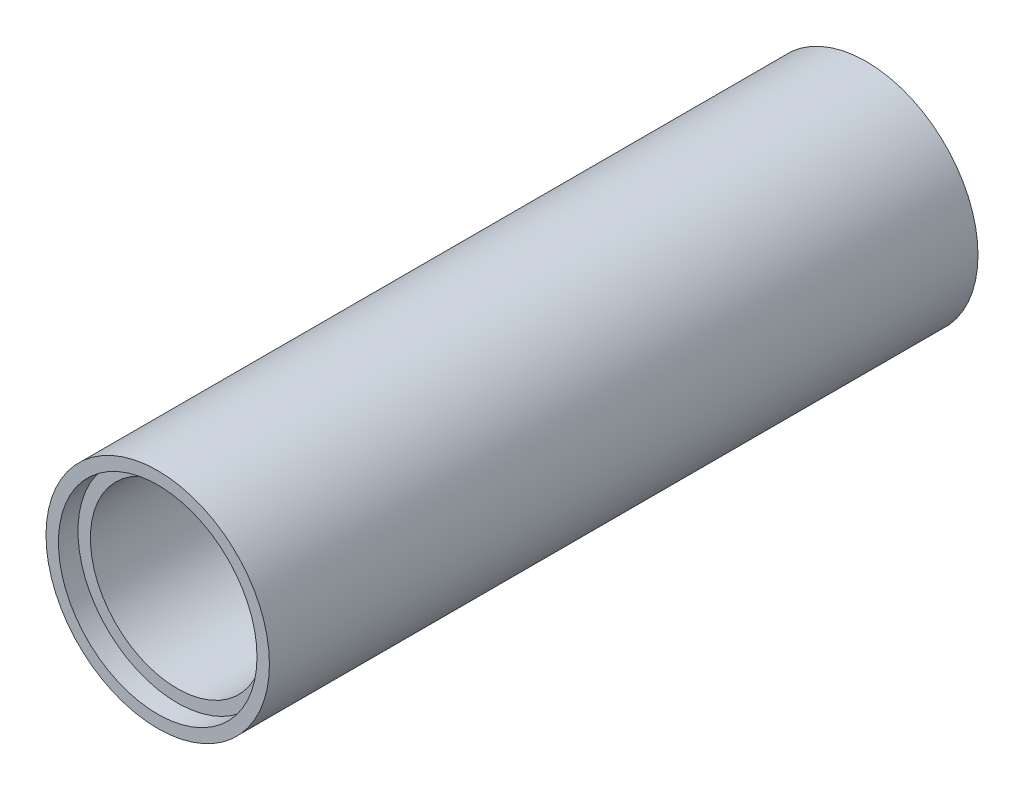
ISO-10303-21;
HEADER;
FILE_DESCRIPTION(('STEP AP214'),'2;1');
FILE_NAME('part.step','',(''),(''),'','','');
FILE_SCHEMA(('AUTOMOTIVE_DESIGN { 1 0 10303 214 1 1 1 1 }'));
ENDSEC;
DATA;
#1=APPLICATION_CONTEXT('core data for automotive mechanical design processes');
#2=APPLICATION_PROTOCOL_DEFINITION('international standard','automotive_design',2000,#1);
#3=PRODUCT_CONTEXT('',#1,'mechanical');
#4=PRODUCT('Part','Part','',(#3));
#5=PRODUCT_RELATED_PRODUCT_CATEGORY('part','',(#4));
#6=PRODUCT_DEFINITION_FORMATION('','',#4);
#7=PRODUCT_DEFINITION_CONTEXT('part definition',#1,'design');
#8=PRODUCT_DEFINITION('design','',#6,#7);
#9=PRODUCT_DEFINITION_SHAPE('','',#8);
#10=(LENGTH_UNIT() NAMED_UNIT(*) SI_UNIT(.MILLI.,.METRE.));
#11=(NAMED_UNIT(*) PLANE_ANGLE_UNIT() SI_UNIT($,.RADIAN.));
#12=(NAMED_UNIT(*) SI_UNIT($,.STERADIAN.) SOLID_ANGLE_UNIT());
#13=UNCERTAINTY_MEASURE_WITH_UNIT(LENGTH_MEASURE(1.E-05),#10,'distance_accuracy_value','');
#14=(GEOMETRIC_REPRESENTATION_CONTEXT(3) GLOBAL_UNCERTAINTY_ASSIGNED_CONTEXT((#13)) GLOBAL_UNIT_ASSIGNED_CONTEXT((#10,
#11,#12)) REPRESENTATION_CONTEXT('',''));
#15=CARTESIAN_POINT('',(0.,0.,0.));
#16=DIRECTION('',(0.,0.,1.));
#17=DIRECTION('',(1.,0.,0.));
#18=AXIS2_PLACEMENT_3D('',#15,#16,#17);
#19=CARTESIAN_POINT('',(0.,0.,362.5));
#20=DIRECTION('',(0.,0.,-1.));
#21=DIRECTION('',(-1.,0.,0.));
#22=AXIS2_PLACEMENT_3D('',#19,#20,#21);
#23=CYLINDRICAL_SURFACE('',#22,44.45);
#24=CARTESIAN_POINT('',(0.,0.,0.));
#25=DIRECTION('',(0.,0.,1.));
#26=DIRECTION('',(1.,0.,0.));
#27=AXIS2_PLACEMENT_3D('',#24,#25,#26);
#28=CIRCLE('',#27,44.45);
#29=CARTESIAN_POINT('',(44.45,0.,0.));
#30=VERTEX_POINT('',#29);
#31=EDGE_CURVE('E45',#30,#30,#28,.T.);
#32=ORIENTED_EDGE('',*,*,#31,.F.);
#33=EDGE_LOOP('',(#32));
#34=FACE_BOUND('',#33,.T.);
#35=CARTESIAN_POINT('',(0.,0.,352.5));
#36=DIRECTION('',(0.,0.,1.));
#37=DIRECTION('',(1.,0.,0.));
#38=AXIS2_PLACEMENT_3D('',#35,#36,#37);
#39=CIRCLE('',#38,44.45);
#40=CARTESIAN_POINT('',(44.45,0.,352.5));
#41=VERTEX_POINT('',#40);
#42=EDGE_CURVE('E53',#41,#41,#39,.T.);
#43=ORIENTED_EDGE('',*,*,#42,.T.);
#44=EDGE_LOOP('',(#43));
#45=FACE_BOUND('',#44,.T.);
#46=ADVANCED_FACE('F34',(#34,#45),#23,.F.);
#47=CARTESIAN_POINT('',(0.,0.,362.5));
#48=DIRECTION('',(0.,0.,1.));
#49=DIRECTION('',(1.,0.,0.));
#50=AXIS2_PLACEMENT_3D('',#47,#48,#49);
#51=PLANE('',#50);
#52=CARTESIAN_POINT('',(0.,0.,362.5));
#53=DIRECTION('',(0.,0.,1.));
#54=DIRECTION('',(1.,0.,0.));
#55=AXIS2_PLACEMENT_3D('',#52,#53,#54);
#56=CIRCLE('',#55,50.8);
#57=CARTESIAN_POINT('',(50.8,0.,362.5));
#58=VERTEX_POINT('',#57);
#59=EDGE_CURVE('E50',#58,#58,#56,.T.);
#60=ORIENTED_EDGE('',*,*,#59,.F.);
#61=EDGE_LOOP('',(#60));
#62=FACE_BOUND('',#61,.T.);
#63=CARTESIAN_POINT('',(0.,0.,362.5));
#64=DIRECTION('',(0.,0.,1.));
#65=DIRECTION('',(1.,0.,0.));
#66=AXIS2_PLACEMENT_3D('',#63,#64,#65);
#67=CIRCLE('',#66,57.15);
#68=CARTESIAN_POINT('',(57.15,0.,362.5));
#69=VERTEX_POINT('',#68);
#70=EDGE_CURVE('E10',#69,#69,#67,.T.);
#71=ORIENTED_EDGE('',*,*,#70,.T.);
#72=EDGE_LOOP('',(#71));
#73=FACE_BOUND('',#72,.T.);
#74=ADVANCED_FACE('F72',(#62,#73),#51,.T.);
#75=CARTESIAN_POINT('',(0.,0.,0.));
#76=DIRECTION('',(0.,0.,1.));
#77=DIRECTION('',(1.,0.,0.));
#78=AXIS2_PLACEMENT_3D('',#75,#76,#77);
#79=PLANE('',#78);
#80=CARTESIAN_POINT('',(0.,0.,0.));
#81=DIRECTION('',(0.,0.,1.));
#82=DIRECTION('',(1.,0.,0.));
#83=AXIS2_PLACEMENT_3D('',#80,#81,#82);
#84=CIRCLE('',#83,57.15);
#85=CARTESIAN_POINT('',(57.15,0.,0.));
#86=VERTEX_POINT('',#85);
#87=EDGE_CURVE('E38',#86,#86,#84,.T.);
#88=ORIENTED_EDGE('',*,*,#87,.F.);
#89=EDGE_LOOP('',(#88));
#90=FACE_BOUND('',#89,.T.);
#91=ORIENTED_EDGE('',*,*,#31,.T.);
#92=EDGE_LOOP('',(#91));
#93=FACE_BOUND('',#92,.T.);
#94=ADVANCED_FACE('F74',(#90,#93),#79,.F.);
#95=CARTESIAN_POINT('',(0.,0.,362.5));
#96=DIRECTION('',(0.,0.,-1.));
#97=DIRECTION('',(-1.,0.,0.));
#98=AXIS2_PLACEMENT_3D('',#95,#96,#97);
#99=CYLINDRICAL_SURFACE('',#98,57.15);
#100=ORIENTED_EDGE('',*,*,#70,.F.);
#101=EDGE_LOOP('',(#100));
#102=FACE_BOUND('',#101,.T.);
#103=ORIENTED_EDGE('',*,*,#87,.T.);
#104=EDGE_LOOP('',(#103));
#105=FACE_BOUND('',#104,.T.);
#106=ADVANCED_FACE('F36',(#102,#105),#99,.T.);
#107=CARTESIAN_POINT('',(0.,0.,352.5));
#108=DIRECTION('',(0.,0.,1.));
#109=DIRECTION('',(1.,0.,0.));
#110=AXIS2_PLACEMENT_3D('',#107,#108,#109);
#111=CYLINDRICAL_SURFACE('',#110,50.8);
#112=CARTESIAN_POINT('',(0.,0.,352.5));
#113=DIRECTION('',(0.,0.,1.));
#114=DIRECTION('',(1.,0.,0.));
#115=AXIS2_PLACEMENT_3D('',#112,#113,#114);
#116=CIRCLE('',#115,50.8);
#117=CARTESIAN_POINT('',(50.8,0.,352.5));
#118=VERTEX_POINT('',#117);
#119=EDGE_CURVE('E49',#118,#118,#116,.T.);
#120=ORIENTED_EDGE('',*,*,#119,.F.);
#121=EDGE_LOOP('',(#120));
#122=FACE_BOUND('',#121,.T.);
#123=ORIENTED_EDGE('',*,*,#59,.T.);
#124=EDGE_LOOP('',(#123));
#125=FACE_BOUND('',#124,.T.);
#126=ADVANCED_FACE('F63',(#122,#125),#111,.F.);
#127=CARTESIAN_POINT('',(0.,0.,352.5));
#128=DIRECTION('',(0.,0.,1.));
#129=DIRECTION('',(1.,0.,0.));
#130=AXIS2_PLACEMENT_3D('',#127,#128,#129);
#131=PLANE('',#130);
#132=ORIENTED_EDGE('',*,*,#42,.F.);
#133=EDGE_LOOP('',(#132));
#134=FACE_BOUND('',#133,.T.);
#135=ORIENTED_EDGE('',*,*,#119,.T.);
#136=EDGE_LOOP('',(#135));
#137=FACE_BOUND('',#136,.T.);
#138=ADVANCED_FACE('F60',(#134,#137),#131,.T.);
#139=CLOSED_SHELL('',(#46,#74,#94,#106,#126,#138));
#140=MANIFOLD_SOLID_BREP('B2',#139);
#141=ADVANCED_BREP_SHAPE_REPRESENTATION('',(#18,#140),#14);
#142=SHAPE_DEFINITION_REPRESENTATION(#9,#141);
ENDSEC;
END-ISO-10303-21;
